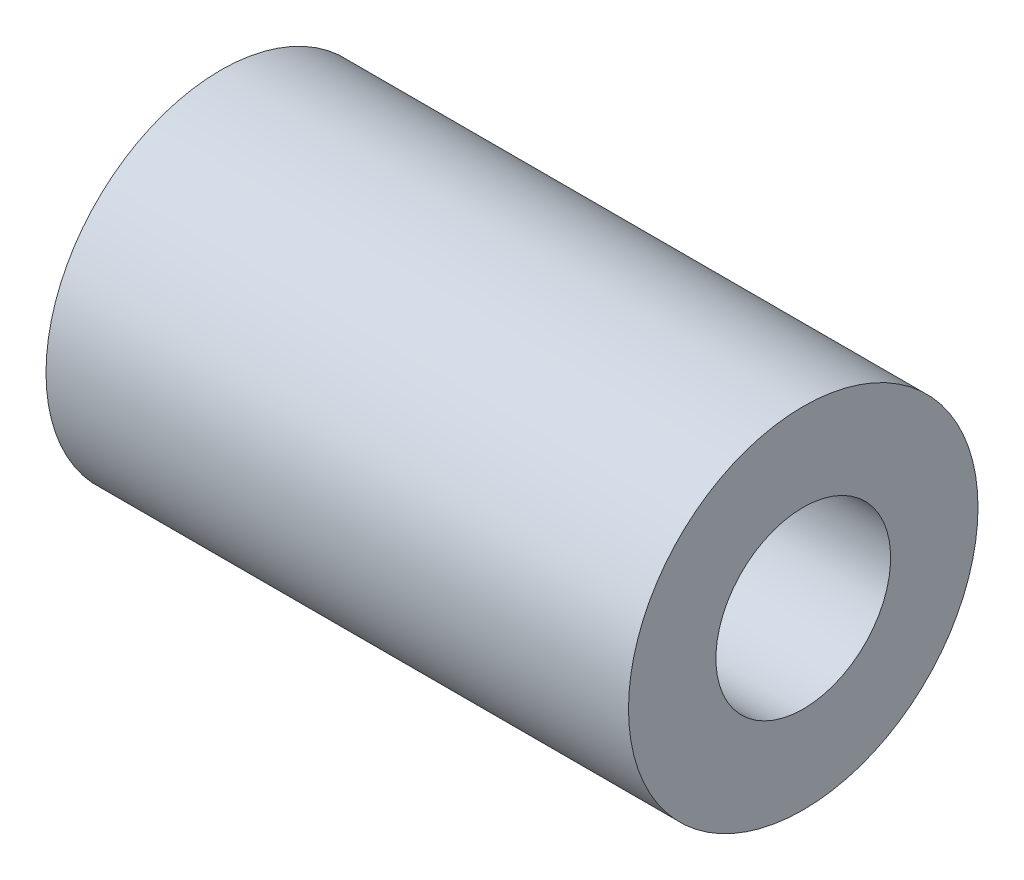
ISO-10303-21;
HEADER;
FILE_DESCRIPTION(('STEP AP214'),'2;1');
FILE_NAME('part.step','',(''),(''),'','','');
FILE_SCHEMA(('AUTOMOTIVE_DESIGN { 1 0 10303 214 1 1 1 1 }'));
ENDSEC;
DATA;
#1=APPLICATION_CONTEXT('core data for automotive mechanical design processes');
#2=APPLICATION_PROTOCOL_DEFINITION('international standard','automotive_design',2000,#1);
#3=PRODUCT_CONTEXT('',#1,'mechanical');
#4=PRODUCT('Part','Part','',(#3));
#5=PRODUCT_RELATED_PRODUCT_CATEGORY('part','',(#4));
#6=PRODUCT_DEFINITION_FORMATION('','',#4);
#7=PRODUCT_DEFINITION_CONTEXT('part definition',#1,'design');
#8=PRODUCT_DEFINITION('design','',#6,#7);
#9=PRODUCT_DEFINITION_SHAPE('','',#8);
#10=(LENGTH_UNIT() NAMED_UNIT(*) SI_UNIT(.MILLI.,.METRE.));
#11=(NAMED_UNIT(*) PLANE_ANGLE_UNIT() SI_UNIT($,.RADIAN.));
#12=(NAMED_UNIT(*) SI_UNIT($,.STERADIAN.) SOLID_ANGLE_UNIT());
#13=UNCERTAINTY_MEASURE_WITH_UNIT(LENGTH_MEASURE(1.E-05),#10,'distance_accuracy_value','');
#14=(GEOMETRIC_REPRESENTATION_CONTEXT(3) GLOBAL_UNCERTAINTY_ASSIGNED_CONTEXT((#13)) GLOBAL_UNIT_ASSIGNED_CONTEXT((#10,
#11,#12)) REPRESENTATION_CONTEXT('',''));
#15=CARTESIAN_POINT('',(0.,0.,0.));
#16=DIRECTION('',(0.,0.,1.));
#17=DIRECTION('',(1.,0.,0.));
#18=AXIS2_PLACEMENT_3D('',#15,#16,#17);
#19=CARTESIAN_POINT('',(0.,0.,0.));
#20=DIRECTION('',(-1.,0.,0.));
#21=DIRECTION('',(0.,-1.,0.));
#22=AXIS2_PLACEMENT_3D('',#19,#20,#21);
#23=PLANE('',#22);
#24=CARTESIAN_POINT('',(0.,0.,0.));
#25=DIRECTION('',(1.,0.,0.));
#26=DIRECTION('',(0.,1.,0.));
#27=AXIS2_PLACEMENT_3D('',#24,#25,#26);
#28=CIRCLE('',#27,6.);
#29=CARTESIAN_POINT('',(0.,6.,0.));
#30=VERTEX_POINT('',#29);
#31=EDGE_CURVE('E10',#30,#30,#28,.T.);
#32=ORIENTED_EDGE('',*,*,#31,.F.);
#33=EDGE_LOOP('',(#32));
#34=FACE_BOUND('',#33,.T.);
#35=ADVANCED_FACE('F30',(#34),#23,.T.);
#36=CARTESIAN_POINT('',(10.,0.,0.));
#37=DIRECTION('',(1.,0.,0.));
#38=DIRECTION('',(0.,1.,0.));
#39=AXIS2_PLACEMENT_3D('',#36,#37,#38);
#40=CYLINDRICAL_SURFACE('',#39,6.);
#41=ORIENTED_EDGE('',*,*,#31,.T.);
#42=EDGE_LOOP('',(#41));
#43=FACE_BOUND('',#42,.T.);
#44=CARTESIAN_POINT('',(20.,0.,0.));
#45=DIRECTION('',(1.,0.,0.));
#46=DIRECTION('',(0.,1.,0.));
#47=AXIS2_PLACEMENT_3D('',#44,#45,#46);
#48=CIRCLE('',#47,6.);
#49=CARTESIAN_POINT('',(20.,6.,0.));
#50=VERTEX_POINT('',#49);
#51=EDGE_CURVE('E36',#50,#50,#48,.T.);
#52=ORIENTED_EDGE('',*,*,#51,.F.);
#53=EDGE_LOOP('',(#52));
#54=FACE_BOUND('',#53,.T.);
#55=ADVANCED_FACE('F62',(#43,#54),#40,.T.);
#56=CARTESIAN_POINT('',(20.,6.,0.));
#57=DIRECTION('',(1.,0.,0.));
#58=DIRECTION('',(0.,1.,0.));
#59=AXIS2_PLACEMENT_3D('',#56,#57,#58);
#60=PLANE('',#59);
#61=ORIENTED_EDGE('',*,*,#51,.T.);
#62=EDGE_LOOP('',(#61));
#63=FACE_BOUND('',#62,.T.);
#64=CARTESIAN_POINT('',(20.,0.,0.));
#65=DIRECTION('',(1.,0.,0.));
#66=DIRECTION('',(0.,1.,0.));
#67=AXIS2_PLACEMENT_3D('',#64,#65,#66);
#68=CIRCLE('',#67,3.);
#69=CARTESIAN_POINT('',(20.,3.,0.));
#70=VERTEX_POINT('',#69);
#71=EDGE_CURVE('E40',#70,#70,#68,.T.);
#72=ORIENTED_EDGE('',*,*,#71,.F.);
#73=EDGE_LOOP('',(#72));
#74=FACE_BOUND('',#73,.T.);
#75=ADVANCED_FACE('F54',(#63,#74),#60,.T.);
#76=CARTESIAN_POINT('',(10.,0.,0.));
#77=DIRECTION('',(1.,0.,0.));
#78=DIRECTION('',(0.,1.,0.));
#79=AXIS2_PLACEMENT_3D('',#76,#77,#78);
#80=CYLINDRICAL_SURFACE('',#79,3.);
#81=ORIENTED_EDGE('',*,*,#71,.T.);
#82=EDGE_LOOP('',(#81));
#83=FACE_BOUND('',#82,.T.);
#84=CARTESIAN_POINT('',(10.,0.,0.));
#85=DIRECTION('',(1.,0.,0.));
#86=DIRECTION('',(0.,1.,0.));
#87=AXIS2_PLACEMENT_3D('',#84,#85,#86);
#88=CIRCLE('',#87,3.);
#89=CARTESIAN_POINT('',(10.,3.,0.));
#90=VERTEX_POINT('',#89);
#91=EDGE_CURVE('E44',#90,#90,#88,.T.);
#92=ORIENTED_EDGE('',*,*,#91,.F.);
#93=EDGE_LOOP('',(#92));
#94=FACE_BOUND('',#93,.T.);
#95=ADVANCED_FACE('F52',(#83,#94),#80,.F.);
#96=CARTESIAN_POINT('',(10.,3.,0.));
#97=DIRECTION('',(1.,0.,0.));
#98=DIRECTION('',(0.,1.,0.));
#99=AXIS2_PLACEMENT_3D('',#96,#97,#98);
#100=PLANE('',#99);
#101=ORIENTED_EDGE('',*,*,#91,.T.);
#102=EDGE_LOOP('',(#101));
#103=FACE_BOUND('',#102,.T.);
#104=ADVANCED_FACE('F50',(#103),#100,.T.);
#105=CLOSED_SHELL('',(#35,#55,#75,#95,#104));
#106=MANIFOLD_SOLID_BREP('B2',#105);
#107=ADVANCED_BREP_SHAPE_REPRESENTATION('',(#18,#106),#14);
#108=SHAPE_DEFINITION_REPRESENTATION(#9,#107);
ENDSEC;
END-ISO-10303-21;
